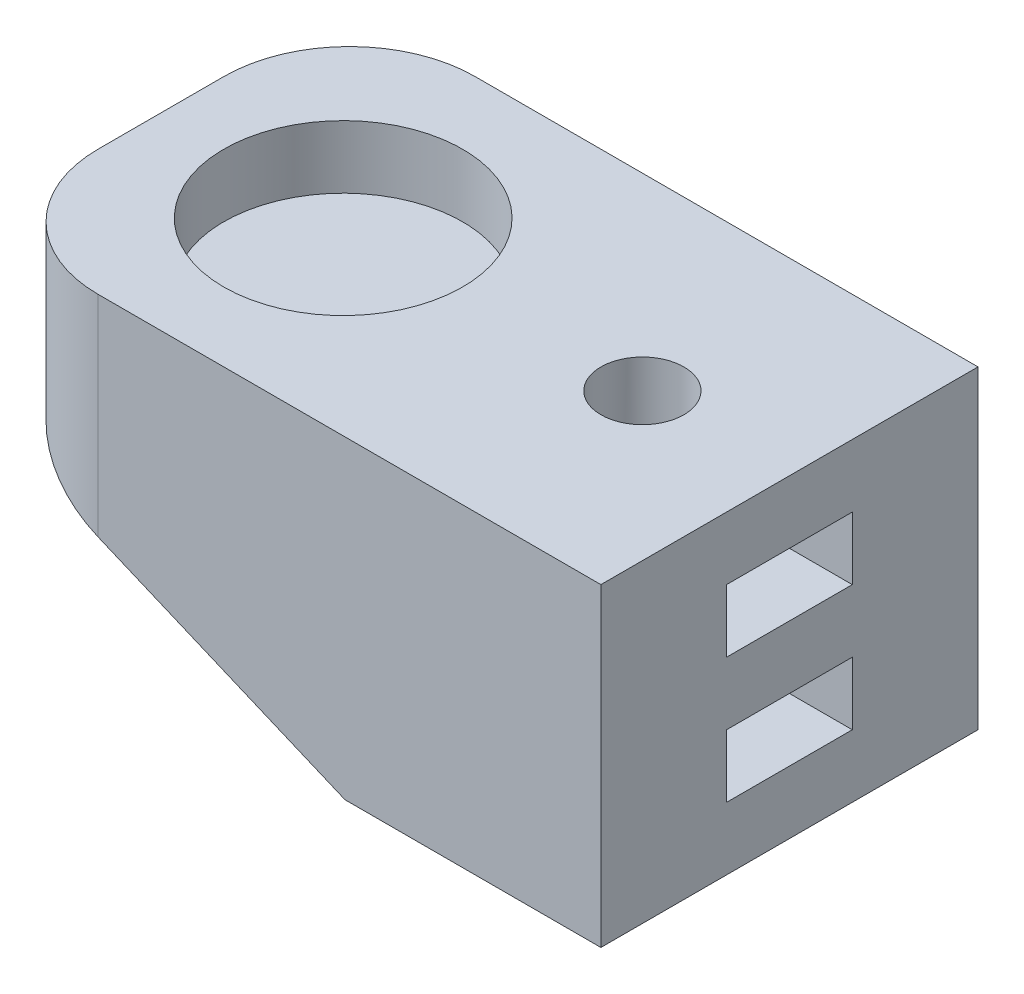
ISO-10303-21;
HEADER;
FILE_DESCRIPTION(('STEP AP214'),'2;1');
FILE_NAME('part.step','',(''),(''),'','','');
FILE_SCHEMA(('AUTOMOTIVE_DESIGN { 1 0 10303 214 1 1 1 1 }'));
ENDSEC;
DATA;
#1=APPLICATION_CONTEXT('core data for automotive mechanical design processes');
#2=APPLICATION_PROTOCOL_DEFINITION('international standard','automotive_design',2000,#1);
#3=PRODUCT_CONTEXT('',#1,'mechanical');
#4=PRODUCT('Part','Part','',(#3));
#5=PRODUCT_RELATED_PRODUCT_CATEGORY('part','',(#4));
#6=PRODUCT_DEFINITION_FORMATION('','',#4);
#7=PRODUCT_DEFINITION_CONTEXT('part definition',#1,'design');
#8=PRODUCT_DEFINITION('design','',#6,#7);
#9=PRODUCT_DEFINITION_SHAPE('','',#8);
#10=(LENGTH_UNIT() NAMED_UNIT(*) SI_UNIT(.MILLI.,.METRE.));
#11=(NAMED_UNIT(*) PLANE_ANGLE_UNIT() SI_UNIT($,.RADIAN.));
#12=(NAMED_UNIT(*) SI_UNIT($,.STERADIAN.) SOLID_ANGLE_UNIT());
#13=UNCERTAINTY_MEASURE_WITH_UNIT(LENGTH_MEASURE(1.E-05),#10,'distance_accuracy_value','');
#14=(GEOMETRIC_REPRESENTATION_CONTEXT(3) GLOBAL_UNCERTAINTY_ASSIGNED_CONTEXT((#13)) GLOBAL_UNIT_ASSIGNED_CONTEXT((#10,
#11,#12)) REPRESENTATION_CONTEXT('',''));
#15=CARTESIAN_POINT('',(0.,0.,0.));
#16=DIRECTION('',(0.,0.,1.));
#17=DIRECTION('',(1.,0.,0.));
#18=AXIS2_PLACEMENT_3D('',#15,#16,#17);
#19=CARTESIAN_POINT('',(-10.5419782215743,25.,-46.9400359779606));
#20=DIRECTION('',(-1.,0.,0.));
#21=DIRECTION('',(0.,0.,1.));
#22=AXIS2_PLACEMENT_3D('',#19,#20,#21);
#23=PLANE('',#22);
#24=DIRECTION('',(0.,0.,1.));
#25=VECTOR('',#24,1.);
#26=CARTESIAN_POINT('',(-10.5419782215743,10.,0.));
#27=LINE('',#26,#25);
#28=CARTESIAN_POINT('',(-10.5419782215743,10.,-36.9400359779606));
#29=VERTEX_POINT('',#28);
#30=CARTESIAN_POINT('',(-10.5419782215743,10.,-26.9400359779606));
#31=VERTEX_POINT('',#30);
#32=EDGE_CURVE('E212',#29,#31,#27,.T.);
#33=ORIENTED_EDGE('',*,*,#32,.F.);
#34=DIRECTION('',(0.,-1.,0.));
#35=VECTOR('',#34,1.);
#36=CARTESIAN_POINT('',(-10.5419782215743,10.,-36.9400359779606));
#37=LINE('',#36,#35);
#38=CARTESIAN_POINT('',(-10.5419782215743,5.,-36.9400359779606));
#39=VERTEX_POINT('',#38);
#40=EDGE_CURVE('E224',#29,#39,#37,.T.);
#41=ORIENTED_EDGE('',*,*,#40,.T.);
#42=DIRECTION('',(0.,0.,1.));
#43=VECTOR('',#42,1.);
#44=CARTESIAN_POINT('',(-10.5419782215743,5.,0.));
#45=LINE('',#44,#43);
#46=CARTESIAN_POINT('',(-10.5419782215743,5.,-26.9400359779606));
#47=VERTEX_POINT('',#46);
#48=EDGE_CURVE('E230',#39,#47,#45,.T.);
#49=ORIENTED_EDGE('',*,*,#48,.T.);
#50=DIRECTION('',(0.,-1.,0.));
#51=VECTOR('',#50,1.);
#52=CARTESIAN_POINT('',(-10.5419782215743,10.,-26.9400359779606));
#53=LINE('',#52,#51);
#54=EDGE_CURVE('E246',#31,#47,#53,.T.);
#55=ORIENTED_EDGE('',*,*,#54,.F.);
#56=EDGE_LOOP('',(#33,#41,#49,#55));
#57=FACE_BOUND('',#56,.T.);
#58=DIRECTION('',(0.,0.,-1.));
#59=VECTOR('',#58,1.);
#60=CARTESIAN_POINT('',(-10.5419782215743,0.,-46.9400359779606));
#61=LINE('',#60,#59);
#62=CARTESIAN_POINT('',(-10.5419782215743,0.,-16.9400359779606));
#63=VERTEX_POINT('',#62);
#64=CARTESIAN_POINT('',(-10.5419782215743,0.,-46.9400359779606));
#65=VERTEX_POINT('',#64);
#66=EDGE_CURVE('E283',#63,#65,#61,.T.);
#67=ORIENTED_EDGE('',*,*,#66,.T.);
#68=DIRECTION('',(0.,-1.,0.));
#69=VECTOR('',#68,1.);
#70=CARTESIAN_POINT('',(-10.5419782215743,25.,-46.9400359779606));
#71=LINE('',#70,#69);
#72=CARTESIAN_POINT('',(-10.5419782215743,25.,-46.9400359779606));
#73=VERTEX_POINT('',#72);
#74=EDGE_CURVE('E281',#73,#65,#71,.T.);
#75=ORIENTED_EDGE('',*,*,#74,.F.);
#76=DIRECTION('',(0.,0.,-1.));
#77=VECTOR('',#76,1.);
#78=CARTESIAN_POINT('',(-10.5419782215743,25.,-46.9400359779606));
#79=LINE('',#78,#77);
#80=CARTESIAN_POINT('',(-10.5419782215743,25.,-16.9400359779606));
#81=VERTEX_POINT('',#80);
#82=EDGE_CURVE('E276',#81,#73,#79,.T.);
#83=ORIENTED_EDGE('',*,*,#82,.F.);
#84=DIRECTION('',(0.,-1.,0.));
#85=VECTOR('',#84,1.);
#86=CARTESIAN_POINT('',(-10.5419782215743,25.,-16.9400359779606));
#87=LINE('',#86,#85);
#88=EDGE_CURVE('E289',#81,#63,#87,.T.);
#89=ORIENTED_EDGE('',*,*,#88,.T.);
#90=EDGE_LOOP('',(#67,#75,#83,#89));
#91=FACE_BOUND('',#90,.T.);
#92=DIRECTION('',(0.,0.,1.));
#93=VECTOR('',#92,1.);
#94=CARTESIAN_POINT('',(-10.5419782215743,20.,0.));
#95=LINE('',#94,#93);
#96=CARTESIAN_POINT('',(-10.5419782215743,20.,-36.9400359779606));
#97=VERTEX_POINT('',#96);
#98=CARTESIAN_POINT('',(-10.5419782215743,20.,-26.9400359779606));
#99=VERTEX_POINT('',#98);
#100=EDGE_CURVE('E170',#97,#99,#95,.T.);
#101=ORIENTED_EDGE('',*,*,#100,.F.);
#102=DIRECTION('',(0.,-1.,0.));
#103=VECTOR('',#102,1.);
#104=CARTESIAN_POINT('',(-10.5419782215743,20.,-36.9400359779606));
#105=LINE('',#104,#103);
#106=CARTESIAN_POINT('',(-10.5419782215743,15.,-36.9400359779606));
#107=VERTEX_POINT('',#106);
#108=EDGE_CURVE('E153',#97,#107,#105,.T.);
#109=ORIENTED_EDGE('',*,*,#108,.T.);
#110=DIRECTION('',(0.,0.,1.));
#111=VECTOR('',#110,1.);
#112=CARTESIAN_POINT('',(-10.5419782215743,15.,0.));
#113=LINE('',#112,#111);
#114=CARTESIAN_POINT('',(-10.5419782215743,15.,-26.9400359779606));
#115=VERTEX_POINT('',#114);
#116=EDGE_CURVE('E188',#107,#115,#113,.T.);
#117=ORIENTED_EDGE('',*,*,#116,.T.);
#118=DIRECTION('',(0.,-1.,0.));
#119=VECTOR('',#118,1.);
#120=CARTESIAN_POINT('',(-10.5419782215743,20.,-26.9400359779606));
#121=LINE('',#120,#119);
#122=EDGE_CURVE('E163',#99,#115,#121,.T.);
#123=ORIENTED_EDGE('',*,*,#122,.F.);
#124=EDGE_LOOP('',(#101,#109,#117,#123));
#125=FACE_BOUND('',#124,.T.);
#126=ADVANCED_FACE('F32',(#57,#91,#125),#23,.F.);
#127=CARTESIAN_POINT('',(-22.2401365745473,-5.,-31.9400359779606));
#128=DIRECTION('',(0.,1.,0.));
#129=DIRECTION('',(0.,0.,1.));
#130=AXIS2_PLACEMENT_3D('',#127,#128,#129);
#131=CYLINDRICAL_SURFACE('',#130,3.3);
#132=CARTESIAN_POINT('',(-22.2401365745473,25.,-31.9400359779606));
#133=DIRECTION('',(0.,1.,0.));
#134=DIRECTION('',(0.,0.,1.));
#135=AXIS2_PLACEMENT_3D('',#132,#133,#134);
#136=CIRCLE('',#135,3.3);
#137=CARTESIAN_POINT('',(-22.2401365745473,25.,-28.6400359779606));
#138=VERTEX_POINT('',#137);
#139=EDGE_CURVE('E257',#138,#138,#136,.T.);
#140=ORIENTED_EDGE('',*,*,#139,.T.);
#141=EDGE_LOOP('',(#140));
#142=FACE_BOUND('',#141,.T.);
#143=CARTESIAN_POINT('',(-22.2401365745473,20.,-31.9400359779606));
#144=DIRECTION('',(0.,-1.,0.));
#145=DIRECTION('',(0.,0.,-1.));
#146=AXIS2_PLACEMENT_3D('',#143,#144,#145);
#147=CIRCLE('',#146,3.3);
#148=CARTESIAN_POINT('',(-22.2401365745473,20.,-35.2400359779606));
#149=VERTEX_POINT('',#148);
#150=EDGE_CURVE('E174',#149,#149,#147,.F.);
#151=ORIENTED_EDGE('',*,*,#150,.F.);
#152=EDGE_LOOP('',(#151));
#153=FACE_BOUND('',#152,.T.);
#154=ADVANCED_FACE('F343',(#142,#153),#131,.F.);
#155=CARTESIAN_POINT('',(-22.2401365745473,15.,-31.9400359779606));
#156=DIRECTION('',(0.,-1.,0.));
#157=DIRECTION('',(0.,0.,-1.));
#158=AXIS2_PLACEMENT_3D('',#155,#156,#157);
#159=CIRCLE('',#158,3.3);
#160=CARTESIAN_POINT('',(-22.2401365745473,15.,-35.2400359779606));
#161=VERTEX_POINT('',#160);
#162=EDGE_CURVE('E184',#161,#161,#159,.F.);
#163=ORIENTED_EDGE('',*,*,#162,.T.);
#164=EDGE_LOOP('',(#163));
#165=FACE_BOUND('',#164,.T.);
#166=CARTESIAN_POINT('',(-22.2401365745473,10.,-31.9400359779606));
#167=DIRECTION('',(0.,-1.,0.));
#168=DIRECTION('',(0.,0.,-1.));
#169=AXIS2_PLACEMENT_3D('',#166,#167,#168);
#170=CIRCLE('',#169,3.3);
#171=CARTESIAN_POINT('',(-22.2401365745473,10.,-35.2400359779606));
#172=VERTEX_POINT('',#171);
#173=EDGE_CURVE('E205',#172,#172,#170,.F.);
#174=ORIENTED_EDGE('',*,*,#173,.F.);
#175=EDGE_LOOP('',(#174));
#176=FACE_BOUND('',#175,.T.);
#177=ADVANCED_FACE('F349',(#165,#176),#131,.F.);
#178=CARTESIAN_POINT('',(-60.5419782215743,25.,-46.9400359779606));
#179=DIRECTION('',(1.,0.,0.));
#180=DIRECTION('',(0.,0.,-1.));
#181=AXIS2_PLACEMENT_3D('',#178,#179,#180);
#182=PLANE('',#181);
#183=DIRECTION('',(0.,0.,-1.));
#184=VECTOR('',#183,1.);
#185=CARTESIAN_POINT('',(-60.5419782215743,12.5,-16.9400359779606));
#186=LINE('',#185,#184);
#187=CARTESIAN_POINT('',(-60.5419782215743,12.5,-26.9400359779606));
#188=VERTEX_POINT('',#187);
#189=CARTESIAN_POINT('',(-60.5419782215743,12.5,-36.9400359779606));
#190=VERTEX_POINT('',#189);
#191=EDGE_CURVE('E252',#188,#190,#186,.T.);
#192=ORIENTED_EDGE('',*,*,#191,.F.);
#193=DIRECTION('',(0.,-1.,0.));
#194=VECTOR('',#193,1.);
#195=CARTESIAN_POINT('',(-60.5419782215743,25.,-26.9400359779606));
#196=LINE('',#195,#194);
#197=CARTESIAN_POINT('',(-60.5419782215743,25.,-26.9400359779606));
#198=VERTEX_POINT('',#197);
#199=EDGE_CURVE('E304',#188,#198,#196,.F.);
#200=ORIENTED_EDGE('',*,*,#199,.T.);
#201=DIRECTION('',(0.,0.,1.));
#202=VECTOR('',#201,1.);
#203=CARTESIAN_POINT('',(-60.5419782215743,25.,-46.9400359779606));
#204=LINE('',#203,#202);
#205=CARTESIAN_POINT('',(-60.5419782215743,25.,-36.9400359779606));
#206=VERTEX_POINT('',#205);
#207=EDGE_CURVE('E270',#206,#198,#204,.T.);
#208=ORIENTED_EDGE('',*,*,#207,.F.);
#209=DIRECTION('',(0.,-1.,0.));
#210=VECTOR('',#209,1.);
#211=CARTESIAN_POINT('',(-60.5419782215743,25.,-36.9400359779606));
#212=LINE('',#211,#210);
#213=EDGE_CURVE('E301',#206,#190,#212,.T.);
#214=ORIENTED_EDGE('',*,*,#213,.T.);
#215=EDGE_LOOP('',(#192,#200,#208,#214));
#216=FACE_BOUND('',#215,.T.);
#217=ADVANCED_FACE('F326',(#216),#182,.F.);
#218=CARTESIAN_POINT('',(-60.5419782215743,25.,-16.9400359779606));
#219=DIRECTION('',(0.,0.,-1.));
#220=DIRECTION('',(-1.,0.,0.));
#221=AXIS2_PLACEMENT_3D('',#218,#219,#220);
#222=PLANE('',#221);
#223=DIRECTION('',(1.,0.,0.));
#224=VECTOR('',#223,1.);
#225=CARTESIAN_POINT('',(-60.5419782215743,25.,-16.9400359779606));
#226=LINE('',#225,#224);
#227=CARTESIAN_POINT('',(-50.5419782215743,25.,-16.9400359779606));
#228=VERTEX_POINT('',#227);
#229=EDGE_CURVE('E273',#228,#81,#226,.T.);
#230=ORIENTED_EDGE('',*,*,#229,.F.);
#231=DIRECTION('',(0.,-1.,0.));
#232=VECTOR('',#231,1.);
#233=CARTESIAN_POINT('',(-50.5419782215743,25.,-16.9400359779606));
#234=LINE('',#233,#232);
#235=CARTESIAN_POINT('',(-50.5419782215743,8.28276018423501,-16.9400359779606));
#236=VERTEX_POINT('',#235);
#237=EDGE_CURVE('E292',#228,#236,#234,.T.);
#238=ORIENTED_EDGE('',*,*,#237,.T.);
#239=DIRECTION('',(0.921413988006247,-0.388582375702274,0.));
#240=VECTOR('',#239,1.);
#241=CARTESIAN_POINT('',(-30.9017382872167,0.,-16.9400359779606));
#242=LINE('',#241,#240);
#243=CARTESIAN_POINT('',(-30.9017382872167,0.,-16.9400359779606));
#244=VERTEX_POINT('',#243);
#245=EDGE_CURVE('E250',#236,#244,#242,.T.);
#246=ORIENTED_EDGE('',*,*,#245,.T.);
#247=DIRECTION('',(1.,0.,0.));
#248=VECTOR('',#247,1.);
#249=CARTESIAN_POINT('',(-60.5419782215743,0.,-16.9400359779606));
#250=LINE('',#249,#248);
#251=EDGE_CURVE('E266',#244,#63,#250,.T.);
#252=ORIENTED_EDGE('',*,*,#251,.T.);
#253=ORIENTED_EDGE('',*,*,#88,.F.);
#254=EDGE_LOOP('',(#230,#238,#246,#252,#253));
#255=FACE_BOUND('',#254,.T.);
#256=ADVANCED_FACE('F317',(#255),#222,.F.);
#257=CARTESIAN_POINT('',(-60.5419782215743,25.,-46.9400359779606));
#258=DIRECTION('',(0.,0.,1.));
#259=DIRECTION('',(1.,0.,0.));
#260=AXIS2_PLACEMENT_3D('',#257,#258,#259);
#261=PLANE('',#260);
#262=DIRECTION('',(0.921413988006247,-0.388582375702274,0.));
#263=VECTOR('',#262,1.);
#264=CARTESIAN_POINT('',(-30.9017382872167,0.,-46.9400359779606));
#265=LINE('',#264,#263);
#266=CARTESIAN_POINT('',(-50.5419782215743,8.28276018423502,-46.9400359779606));
#267=VERTEX_POINT('',#266);
#268=CARTESIAN_POINT('',(-30.9017382872167,0.,-46.9400359779606));
#269=VERTEX_POINT('',#268);
#270=EDGE_CURVE('E241',#267,#269,#265,.T.);
#271=ORIENTED_EDGE('',*,*,#270,.F.);
#272=DIRECTION('',(0.,-1.,0.));
#273=VECTOR('',#272,1.);
#274=CARTESIAN_POINT('',(-50.5419782215743,25.,-46.9400359779606));
#275=LINE('',#274,#273);
#276=CARTESIAN_POINT('',(-50.5419782215743,25.,-46.9400359779606));
#277=VERTEX_POINT('',#276);
#278=EDGE_CURVE('E11',#267,#277,#275,.F.);
#279=ORIENTED_EDGE('',*,*,#278,.T.);
#280=DIRECTION('',(-1.,0.,0.));
#281=VECTOR('',#280,1.);
#282=CARTESIAN_POINT('',(-60.5419782215743,25.,-46.9400359779606));
#283=LINE('',#282,#281);
#284=EDGE_CURVE('E278',#73,#277,#283,.T.);
#285=ORIENTED_EDGE('',*,*,#284,.F.);
#286=ORIENTED_EDGE('',*,*,#74,.T.);
#287=DIRECTION('',(-1.,0.,0.));
#288=VECTOR('',#287,1.);
#289=CARTESIAN_POINT('',(-60.5419782215743,0.,-46.9400359779606));
#290=LINE('',#289,#288);
#291=EDGE_CURVE('E274',#65,#269,#290,.T.);
#292=ORIENTED_EDGE('',*,*,#291,.T.);
#293=EDGE_LOOP('',(#271,#279,#285,#286,#292));
#294=FACE_BOUND('',#293,.T.);
#295=ADVANCED_FACE('F333',(#294),#261,.F.);
#296=CARTESIAN_POINT('',(0.,25.,0.));
#297=DIRECTION('',(0.,1.,0.));
#298=DIRECTION('',(0.,0.,1.));
#299=AXIS2_PLACEMENT_3D('',#296,#297,#298);
#300=PLANE('',#299);
#301=ORIENTED_EDGE('',*,*,#139,.F.);
#302=EDGE_LOOP('',(#301));
#303=FACE_BOUND('',#302,.T.);
#304=CARTESIAN_POINT('',(-46.0419782215743,25.,-31.9400359779606));
#305=DIRECTION('',(0.,1.,0.));
#306=DIRECTION('',(0.,0.,1.));
#307=AXIS2_PLACEMENT_3D('',#304,#305,#306);
#308=CIRCLE('',#307,9.5);
#309=CARTESIAN_POINT('',(-46.0419782215743,25.,-22.4400359779606));
#310=VERTEX_POINT('',#309);
#311=EDGE_CURVE('E267',#310,#310,#308,.T.);
#312=ORIENTED_EDGE('',*,*,#311,.F.);
#313=EDGE_LOOP('',(#312));
#314=FACE_BOUND('',#313,.T.);
#315=ORIENTED_EDGE('',*,*,#207,.T.);
#316=CARTESIAN_POINT('',(-50.5419782215743,25.,-26.9400359779606));
#317=DIRECTION('',(0.,1.,0.));
#318=DIRECTION('',(0.,0.,1.));
#319=AXIS2_PLACEMENT_3D('',#316,#317,#318);
#320=CIRCLE('',#319,10.);
#321=EDGE_CURVE('E40',#198,#228,#320,.T.);
#322=ORIENTED_EDGE('',*,*,#321,.T.);
#323=ORIENTED_EDGE('',*,*,#229,.T.);
#324=ORIENTED_EDGE('',*,*,#82,.T.);
#325=ORIENTED_EDGE('',*,*,#284,.T.);
#326=CARTESIAN_POINT('',(-50.5419782215743,25.,-36.9400359779606));
#327=DIRECTION('',(0.,1.,0.));
#328=DIRECTION('',(0.,0.,1.));
#329=AXIS2_PLACEMENT_3D('',#326,#327,#328);
#330=CIRCLE('',#329,10.);
#331=EDGE_CURVE('E306',#277,#206,#330,.T.);
#332=ORIENTED_EDGE('',*,*,#331,.T.);
#333=EDGE_LOOP('',(#315,#322,#323,#324,#325,#332));
#334=FACE_BOUND('',#333,.T.);
#335=ADVANCED_FACE('F310',(#303,#314,#334),#300,.T.);
#336=CARTESIAN_POINT('',(0.,0.,0.));
#337=DIRECTION('',(0.,1.,0.));
#338=DIRECTION('',(0.,0.,1.));
#339=AXIS2_PLACEMENT_3D('',#336,#337,#338);
#340=PLANE('',#339);
#341=CARTESIAN_POINT('',(-22.2401365745473,0.,-31.9400359779606));
#342=DIRECTION('',(0.,1.,0.));
#343=DIRECTION('',(0.,0.,1.));
#344=AXIS2_PLACEMENT_3D('',#341,#342,#343);
#345=CIRCLE('',#344,3.3);
#346=CARTESIAN_POINT('',(-22.2401365745473,0.,-28.6400359779606));
#347=VERTEX_POINT('',#346);
#348=EDGE_CURVE('E262',#347,#347,#345,.T.);
#349=ORIENTED_EDGE('',*,*,#348,.T.);
#350=EDGE_LOOP('',(#349));
#351=FACE_BOUND('',#350,.T.);
#352=ORIENTED_EDGE('',*,*,#251,.F.);
#353=DIRECTION('',(0.,0.,-1.));
#354=VECTOR('',#353,1.);
#355=CARTESIAN_POINT('',(-30.9017382872167,0.,-16.9400359779606));
#356=LINE('',#355,#354);
#357=EDGE_CURVE('E254',#244,#269,#356,.T.);
#358=ORIENTED_EDGE('',*,*,#357,.T.);
#359=ORIENTED_EDGE('',*,*,#291,.F.);
#360=ORIENTED_EDGE('',*,*,#66,.F.);
#361=EDGE_LOOP('',(#352,#358,#359,#360));
#362=FACE_BOUND('',#361,.T.);
#363=ADVANCED_FACE('F340',(#351,#362),#340,.F.);
#364=CARTESIAN_POINT('',(-46.0419782215743,20.,-31.9400359779606));
#365=DIRECTION('',(0.,1.,0.));
#366=DIRECTION('',(0.,0.,1.));
#367=AXIS2_PLACEMENT_3D('',#364,#365,#366);
#368=CYLINDRICAL_SURFACE('',#367,9.5);
#369=CARTESIAN_POINT('',(-46.0419782215743,20.,-31.9400359779606));
#370=DIRECTION('',(0.,1.,0.));
#371=DIRECTION('',(0.,0.,1.));
#372=AXIS2_PLACEMENT_3D('',#369,#370,#371);
#373=CIRCLE('',#372,9.5);
#374=CARTESIAN_POINT('',(-46.0419782215743,20.,-22.4400359779606));
#375=VERTEX_POINT('',#374);
#376=EDGE_CURVE('E263',#375,#375,#373,.T.);
#377=ORIENTED_EDGE('',*,*,#376,.F.);
#378=EDGE_LOOP('',(#377));
#379=FACE_BOUND('',#378,.T.);
#380=ORIENTED_EDGE('',*,*,#311,.T.);
#381=EDGE_LOOP('',(#380));
#382=FACE_BOUND('',#381,.T.);
#383=ADVANCED_FACE('F377',(#379,#382),#368,.F.);
#384=CARTESIAN_POINT('',(-46.0419782215743,20.,-31.9400359779606));
#385=DIRECTION('',(0.,1.,0.));
#386=DIRECTION('',(0.,0.,1.));
#387=AXIS2_PLACEMENT_3D('',#384,#385,#386);
#388=PLANE('',#387);
#389=ORIENTED_EDGE('',*,*,#376,.T.);
#390=EDGE_LOOP('',(#389));
#391=FACE_BOUND('',#390,.T.);
#392=ADVANCED_FACE('F370',(#391),#388,.T.);
#393=CARTESIAN_POINT('',(-22.2401365745473,5.,-31.9400359779606));
#394=DIRECTION('',(0.,-1.,0.));
#395=DIRECTION('',(0.,0.,-1.));
#396=AXIS2_PLACEMENT_3D('',#393,#394,#395);
#397=CIRCLE('',#396,3.3);
#398=CARTESIAN_POINT('',(-22.2401365745473,5.,-35.2400359779606));
#399=VERTEX_POINT('',#398);
#400=EDGE_CURVE('E199',#399,#399,#397,.F.);
#401=ORIENTED_EDGE('',*,*,#400,.T.);
#402=EDGE_LOOP('',(#401));
#403=FACE_BOUND('',#402,.T.);
#404=ORIENTED_EDGE('',*,*,#348,.F.);
#405=EDGE_LOOP('',(#404));
#406=FACE_BOUND('',#405,.T.);
#407=ADVANCED_FACE('F352',(#403,#406),#131,.F.);
#408=CARTESIAN_POINT('',(-30.9017382872167,0.,-16.9400359779606));
#409=DIRECTION('',(0.388582375702274,0.921413988006247,0.));
#410=DIRECTION('',(-0.921413988006247,0.388582375702274,0.));
#411=AXIS2_PLACEMENT_3D('',#408,#409,#410);
#412=PLANE('',#411);
#413=ORIENTED_EDGE('',*,*,#245,.F.);
#414=CARTESIAN_POINT('',(-50.5419782215743,8.28276018423502,-26.9400359779606));
#415=DIRECTION('',(0.388582375702274,0.921413988006247,0.));
#416=DIRECTION('',(0.921413988006247,-0.388582375702274,0.));
#417=AXIS2_PLACEMENT_3D('',#414,#415,#416);
#418=ELLIPSE('',#417,10.8528849465787,10.);
#419=EDGE_CURVE('E299',#236,#188,#418,.F.);
#420=ORIENTED_EDGE('',*,*,#419,.T.);
#421=ORIENTED_EDGE('',*,*,#191,.T.);
#422=CARTESIAN_POINT('',(-50.5419782215743,8.28276018423502,-36.9400359779606));
#423=DIRECTION('',(0.388582375702274,0.921413988006247,0.));
#424=DIRECTION('',(0.921413988006247,-0.388582375702274,0.));
#425=AXIS2_PLACEMENT_3D('',#422,#423,#424);
#426=ELLIPSE('',#425,10.8528849465787,10.);
#427=EDGE_CURVE('E297',#190,#267,#426,.F.);
#428=ORIENTED_EDGE('',*,*,#427,.T.);
#429=ORIENTED_EDGE('',*,*,#270,.T.);
#430=ORIENTED_EDGE('',*,*,#357,.F.);
#431=EDGE_LOOP('',(#413,#420,#421,#428,#429,#430));
#432=FACE_BOUND('',#431,.T.);
#433=ADVANCED_FACE('F323',(#432),#412,.F.);
#434=CARTESIAN_POINT('',(-50.5419782215743,25.,-26.9400359779606));
#435=DIRECTION('',(0.,-1.,0.));
#436=DIRECTION('',(0.,0.,-1.));
#437=AXIS2_PLACEMENT_3D('',#434,#435,#436);
#438=CYLINDRICAL_SURFACE('',#437,10.);
#439=ORIENTED_EDGE('',*,*,#321,.F.);
#440=ORIENTED_EDGE('',*,*,#199,.F.);
#441=ORIENTED_EDGE('',*,*,#419,.F.);
#442=ORIENTED_EDGE('',*,*,#237,.F.);
#443=EDGE_LOOP('',(#439,#440,#441,#442));
#444=FACE_BOUND('',#443,.T.);
#445=ADVANCED_FACE('F320',(#444),#438,.T.);
#446=CARTESIAN_POINT('',(-50.5419782215743,25.,-36.9400359779606));
#447=DIRECTION('',(0.,-1.,0.));
#448=DIRECTION('',(0.,0.,-1.));
#449=AXIS2_PLACEMENT_3D('',#446,#447,#448);
#450=CYLINDRICAL_SURFACE('',#449,10.);
#451=ORIENTED_EDGE('',*,*,#331,.F.);
#452=ORIENTED_EDGE('',*,*,#278,.F.);
#453=ORIENTED_EDGE('',*,*,#427,.F.);
#454=ORIENTED_EDGE('',*,*,#213,.F.);
#455=EDGE_LOOP('',(#451,#452,#453,#454));
#456=FACE_BOUND('',#455,.T.);
#457=ADVANCED_FACE('F34',(#456),#450,.T.);
#458=CARTESIAN_POINT('',(0.,10.,-36.9400359779606));
#459=DIRECTION('',(0.,0.,-1.));
#460=DIRECTION('',(-1.,0.,0.));
#461=AXIS2_PLACEMENT_3D('',#458,#459,#460);
#462=PLANE('',#461);
#463=DIRECTION('',(1.,0.,0.));
#464=VECTOR('',#463,1.);
#465=CARTESIAN_POINT('',(0.,5.,-36.9400359779606));
#466=LINE('',#465,#464);
#467=CARTESIAN_POINT('',(-25.1268879204953,5.,-36.9400359779606));
#468=VERTEX_POINT('',#467);
#469=EDGE_CURVE('E227',#468,#39,#466,.T.);
#470=ORIENTED_EDGE('',*,*,#469,.T.);
#471=ORIENTED_EDGE('',*,*,#40,.F.);
#472=DIRECTION('',(1.,0.,0.));
#473=VECTOR('',#472,1.);
#474=CARTESIAN_POINT('',(0.,10.,-36.9400359779606));
#475=LINE('',#474,#473);
#476=CARTESIAN_POINT('',(-25.1268879204953,10.,-36.9400359779606));
#477=VERTEX_POINT('',#476);
#478=EDGE_CURVE('E208',#477,#29,#475,.T.);
#479=ORIENTED_EDGE('',*,*,#478,.F.);
#480=DIRECTION('',(0.,-1.,0.));
#481=VECTOR('',#480,1.);
#482=CARTESIAN_POINT('',(-25.1268879204953,10.,-36.9400359779606));
#483=LINE('',#482,#481);
#484=EDGE_CURVE('E239',#477,#468,#483,.T.);
#485=ORIENTED_EDGE('',*,*,#484,.T.);
#486=EDGE_LOOP('',(#470,#471,#479,#485));
#487=FACE_BOUND('',#486,.T.);
#488=ADVANCED_FACE('F365',(#487),#462,.F.);
#489=CARTESIAN_POINT('',(-34.840670727184,10.,-20.1152706230868));
#490=DIRECTION('',(-0.866025403784438,0.,-0.500000000000001));
#491=DIRECTION('',(-0.500000000000001,0.,0.866025403784438));
#492=AXIS2_PLACEMENT_3D('',#489,#490,#491);
#493=PLANE('',#492);
#494=DIRECTION('',(0.500000000000001,0.,-0.866025403784438));
#495=VECTOR('',#494,1.);
#496=CARTESIAN_POINT('',(-34.840670727184,5.,-20.1152706230868));
#497=LINE('',#496,#495);
#498=CARTESIAN_POINT('',(-28.0136392664434,5.,-31.9400359779606));
#499=VERTEX_POINT('',#498);
#500=EDGE_CURVE('E209',#499,#468,#497,.T.);
#501=ORIENTED_EDGE('',*,*,#500,.T.);
#502=ORIENTED_EDGE('',*,*,#484,.F.);
#503=DIRECTION('',(0.500000000000001,0.,-0.866025403784438));
#504=VECTOR('',#503,1.);
#505=CARTESIAN_POINT('',(-34.840670727184,10.,-20.1152706230868));
#506=LINE('',#505,#504);
#507=CARTESIAN_POINT('',(-28.0136392664434,10.,-31.9400359779606));
#508=VERTEX_POINT('',#507);
#509=EDGE_CURVE('E221',#508,#477,#506,.T.);
#510=ORIENTED_EDGE('',*,*,#509,.F.);
#511=DIRECTION('',(0.,-1.,0.));
#512=VECTOR('',#511,1.);
#513=CARTESIAN_POINT('',(-28.0136392664434,10.,-31.9400359779606));
#514=LINE('',#513,#512);
#515=EDGE_CURVE('E242',#508,#499,#514,.T.);
#516=ORIENTED_EDGE('',*,*,#515,.T.);
#517=EDGE_LOOP('',(#501,#502,#510,#516));
#518=FACE_BOUND('',#517,.T.);
#519=ADVANCED_FACE('F419',(#518),#493,.F.);
#520=CARTESIAN_POINT('',(-7.17978817248113,10.,4.14525263410648));
#521=DIRECTION('',(-0.866025403784438,0.,0.5));
#522=DIRECTION('',(0.5,0.,0.866025403784438));
#523=AXIS2_PLACEMENT_3D('',#520,#521,#522);
#524=PLANE('',#523);
#525=DIRECTION('',(-0.5,0.,-0.866025403784439));
#526=VECTOR('',#525,1.);
#527=CARTESIAN_POINT('',(-7.17978817248113,5.,4.14525263410648));
#528=LINE('',#527,#526);
#529=CARTESIAN_POINT('',(-25.1268879204953,5.,-26.9400359779606));
#530=VERTEX_POINT('',#529);
#531=EDGE_CURVE('E234',#530,#499,#528,.T.);
#532=ORIENTED_EDGE('',*,*,#531,.T.);
#533=ORIENTED_EDGE('',*,*,#515,.F.);
#534=DIRECTION('',(-0.5,0.,-0.866025403784439));
#535=VECTOR('',#534,1.);
#536=CARTESIAN_POINT('',(-7.17978817248113,10.,4.14525263410648));
#537=LINE('',#536,#535);
#538=CARTESIAN_POINT('',(-25.1268879204953,10.,-26.9400359779606));
#539=VERTEX_POINT('',#538);
#540=EDGE_CURVE('E218',#539,#508,#537,.T.);
#541=ORIENTED_EDGE('',*,*,#540,.F.);
#542=DIRECTION('',(0.,-1.,0.));
#543=VECTOR('',#542,1.);
#544=CARTESIAN_POINT('',(-25.1268879204953,10.,-26.9400359779606));
#545=LINE('',#544,#543);
#546=EDGE_CURVE('E244',#539,#530,#545,.T.);
#547=ORIENTED_EDGE('',*,*,#546,.T.);
#548=EDGE_LOOP('',(#532,#533,#541,#547));
#549=FACE_BOUND('',#548,.T.);
#550=ADVANCED_FACE('F429',(#549),#524,.F.);
#551=CARTESIAN_POINT('',(0.,10.,-26.9400359779606));
#552=DIRECTION('',(0.,0.,1.));
#553=DIRECTION('',(1.,0.,0.));
#554=AXIS2_PLACEMENT_3D('',#551,#552,#553);
#555=PLANE('',#554);
#556=DIRECTION('',(-1.,0.,0.));
#557=VECTOR('',#556,1.);
#558=CARTESIAN_POINT('',(0.,5.,-26.9400359779606));
#559=LINE('',#558,#557);
#560=EDGE_CURVE('E55',#47,#530,#559,.T.);
#561=ORIENTED_EDGE('',*,*,#560,.T.);
#562=ORIENTED_EDGE('',*,*,#546,.F.);
#563=DIRECTION('',(-1.,0.,0.));
#564=VECTOR('',#563,1.);
#565=CARTESIAN_POINT('',(0.,10.,-26.9400359779606));
#566=LINE('',#565,#564);
#567=EDGE_CURVE('E215',#31,#539,#566,.T.);
#568=ORIENTED_EDGE('',*,*,#567,.F.);
#569=ORIENTED_EDGE('',*,*,#54,.T.);
#570=EDGE_LOOP('',(#561,#562,#568,#569));
#571=FACE_BOUND('',#570,.T.);
#572=ADVANCED_FACE('F439',(#571),#555,.F.);
#573=CARTESIAN_POINT('',(0.,10.,0.));
#574=DIRECTION('',(0.,-1.,0.));
#575=DIRECTION('',(0.,0.,-1.));
#576=AXIS2_PLACEMENT_3D('',#573,#574,#575);
#577=PLANE('',#576);
#578=ORIENTED_EDGE('',*,*,#173,.T.);
#579=EDGE_LOOP('',(#578));
#580=FACE_BOUND('',#579,.T.);
#581=ORIENTED_EDGE('',*,*,#478,.T.);
#582=ORIENTED_EDGE('',*,*,#32,.T.);
#583=ORIENTED_EDGE('',*,*,#567,.T.);
#584=ORIENTED_EDGE('',*,*,#540,.T.);
#585=ORIENTED_EDGE('',*,*,#509,.T.);
#586=EDGE_LOOP('',(#581,#582,#583,#584,#585));
#587=FACE_BOUND('',#586,.T.);
#588=ADVANCED_FACE('F450',(#580,#587),#577,.T.);
#589=CARTESIAN_POINT('',(0.,5.,0.));
#590=DIRECTION('',(0.,-1.,0.));
#591=DIRECTION('',(0.,0.,-1.));
#592=AXIS2_PLACEMENT_3D('',#589,#590,#591);
#593=PLANE('',#592);
#594=ORIENTED_EDGE('',*,*,#400,.F.);
#595=EDGE_LOOP('',(#594));
#596=FACE_BOUND('',#595,.T.);
#597=ORIENTED_EDGE('',*,*,#469,.F.);
#598=ORIENTED_EDGE('',*,*,#500,.F.);
#599=ORIENTED_EDGE('',*,*,#531,.F.);
#600=ORIENTED_EDGE('',*,*,#560,.F.);
#601=ORIENTED_EDGE('',*,*,#48,.F.);
#602=EDGE_LOOP('',(#597,#598,#599,#600,#601));
#603=FACE_BOUND('',#602,.T.);
#604=ADVANCED_FACE('F460',(#596,#603),#593,.F.);
#605=CARTESIAN_POINT('',(0.,20.,-36.9400359779606));
#606=DIRECTION('',(0.,0.,-1.));
#607=DIRECTION('',(-1.,0.,0.));
#608=AXIS2_PLACEMENT_3D('',#605,#606,#607);
#609=PLANE('',#608);
#610=DIRECTION('',(1.,0.,0.));
#611=VECTOR('',#610,1.);
#612=CARTESIAN_POINT('',(0.,15.,-36.9400359779606));
#613=LINE('',#612,#611);
#614=CARTESIAN_POINT('',(-25.1268879204953,15.,-36.9400359779606));
#615=VERTEX_POINT('',#614);
#616=EDGE_CURVE('E159',#615,#107,#613,.T.);
#617=ORIENTED_EDGE('',*,*,#616,.T.);
#618=ORIENTED_EDGE('',*,*,#108,.F.);
#619=DIRECTION('',(1.,0.,0.));
#620=VECTOR('',#619,1.);
#621=CARTESIAN_POINT('',(0.,20.,-36.9400359779606));
#622=LINE('',#621,#620);
#623=CARTESIAN_POINT('',(-25.1268879204953,20.,-36.9400359779606));
#624=VERTEX_POINT('',#623);
#625=EDGE_CURVE('E156',#624,#97,#622,.T.);
#626=ORIENTED_EDGE('',*,*,#625,.F.);
#627=DIRECTION('',(0.,-1.,0.));
#628=VECTOR('',#627,1.);
#629=CARTESIAN_POINT('',(-25.1268879204953,20.,-36.9400359779606));
#630=LINE('',#629,#628);
#631=EDGE_CURVE('E197',#624,#615,#630,.T.);
#632=ORIENTED_EDGE('',*,*,#631,.T.);
#633=EDGE_LOOP('',(#617,#618,#626,#632));
#634=FACE_BOUND('',#633,.T.);
#635=ADVANCED_FACE('F155',(#634),#609,.F.);
#636=CARTESIAN_POINT('',(-34.840670727184,20.,-20.1152706230868));
#637=DIRECTION('',(-0.866025403784438,0.,-0.500000000000001));
#638=DIRECTION('',(-0.500000000000001,0.,0.866025403784438));
#639=AXIS2_PLACEMENT_3D('',#636,#637,#638);
#640=PLANE('',#639);
#641=DIRECTION('',(0.500000000000001,0.,-0.866025403784438));
#642=VECTOR('',#641,1.);
#643=CARTESIAN_POINT('',(-34.840670727184,15.,-20.1152706230868));
#644=LINE('',#643,#642);
#645=CARTESIAN_POINT('',(-28.0136392664434,15.,-31.9400359779606));
#646=VERTEX_POINT('',#645);
#647=EDGE_CURVE('E194',#646,#615,#644,.T.);
#648=ORIENTED_EDGE('',*,*,#647,.T.);
#649=ORIENTED_EDGE('',*,*,#631,.F.);
#650=DIRECTION('',(0.500000000000001,0.,-0.866025403784438));
#651=VECTOR('',#650,1.);
#652=CARTESIAN_POINT('',(-34.840670727184,20.,-20.1152706230868));
#653=LINE('',#652,#651);
#654=CARTESIAN_POINT('',(-28.0136392664434,20.,-31.9400359779606));
#655=VERTEX_POINT('',#654);
#656=EDGE_CURVE('E164',#655,#624,#653,.T.);
#657=ORIENTED_EDGE('',*,*,#656,.F.);
#658=DIRECTION('',(0.,-1.,0.));
#659=VECTOR('',#658,1.);
#660=CARTESIAN_POINT('',(-28.0136392664434,20.,-31.9400359779606));
#661=LINE('',#660,#659);
#662=EDGE_CURVE('E200',#655,#646,#661,.T.);
#663=ORIENTED_EDGE('',*,*,#662,.T.);
#664=EDGE_LOOP('',(#648,#649,#657,#663));
#665=FACE_BOUND('',#664,.T.);
#666=ADVANCED_FACE('F499',(#665),#640,.F.);
#667=CARTESIAN_POINT('',(-7.17978817248113,20.,4.14525263410648));
#668=DIRECTION('',(-0.866025403784438,0.,0.5));
#669=DIRECTION('',(0.5,0.,0.866025403784438));
#670=AXIS2_PLACEMENT_3D('',#667,#668,#669);
#671=PLANE('',#670);
#672=DIRECTION('',(-0.5,0.,-0.866025403784439));
#673=VECTOR('',#672,1.);
#674=CARTESIAN_POINT('',(-7.17978817248113,15.,4.14525263410648));
#675=LINE('',#674,#673);
#676=CARTESIAN_POINT('',(-25.1268879204953,15.,-26.9400359779606));
#677=VERTEX_POINT('',#676);
#678=EDGE_CURVE('E191',#677,#646,#675,.T.);
#679=ORIENTED_EDGE('',*,*,#678,.T.);
#680=ORIENTED_EDGE('',*,*,#662,.F.);
#681=DIRECTION('',(-0.5,0.,-0.866025403784439));
#682=VECTOR('',#681,1.);
#683=CARTESIAN_POINT('',(-7.17978817248113,20.,4.14525263410648));
#684=LINE('',#683,#682);
#685=CARTESIAN_POINT('',(-25.1268879204953,20.,-26.9400359779606));
#686=VERTEX_POINT('',#685);
#687=EDGE_CURVE('E178',#686,#655,#684,.T.);
#688=ORIENTED_EDGE('',*,*,#687,.F.);
#689=DIRECTION('',(0.,-1.,0.));
#690=VECTOR('',#689,1.);
#691=CARTESIAN_POINT('',(-25.1268879204953,20.,-26.9400359779606));
#692=LINE('',#691,#690);
#693=EDGE_CURVE('E202',#686,#677,#692,.T.);
#694=ORIENTED_EDGE('',*,*,#693,.T.);
#695=EDGE_LOOP('',(#679,#680,#688,#694));
#696=FACE_BOUND('',#695,.T.);
#697=ADVANCED_FACE('F508',(#696),#671,.F.);
#698=CARTESIAN_POINT('',(0.,20.,-26.9400359779606));
#699=DIRECTION('',(0.,0.,1.));
#700=DIRECTION('',(1.,0.,0.));
#701=AXIS2_PLACEMENT_3D('',#698,#699,#700);
#702=PLANE('',#701);
#703=DIRECTION('',(-1.,0.,0.));
#704=VECTOR('',#703,1.);
#705=CARTESIAN_POINT('',(0.,15.,-26.9400359779606));
#706=LINE('',#705,#704);
#707=EDGE_CURVE('E47',#115,#677,#706,.T.);
#708=ORIENTED_EDGE('',*,*,#707,.T.);
#709=ORIENTED_EDGE('',*,*,#693,.F.);
#710=DIRECTION('',(-1.,0.,0.));
#711=VECTOR('',#710,1.);
#712=CARTESIAN_POINT('',(0.,20.,-26.9400359779606));
#713=LINE('',#712,#711);
#714=EDGE_CURVE('E176',#99,#686,#713,.T.);
#715=ORIENTED_EDGE('',*,*,#714,.F.);
#716=ORIENTED_EDGE('',*,*,#122,.T.);
#717=EDGE_LOOP('',(#708,#709,#715,#716));
#718=FACE_BOUND('',#717,.T.);
#719=ADVANCED_FACE('F518',(#718),#702,.F.);
#720=CARTESIAN_POINT('',(0.,20.,0.));
#721=DIRECTION('',(0.,-1.,0.));
#722=DIRECTION('',(0.,0.,-1.));
#723=AXIS2_PLACEMENT_3D('',#720,#721,#722);
#724=PLANE('',#723);
#725=ORIENTED_EDGE('',*,*,#150,.T.);
#726=EDGE_LOOP('',(#725));
#727=FACE_BOUND('',#726,.T.);
#728=ORIENTED_EDGE('',*,*,#625,.T.);
#729=ORIENTED_EDGE('',*,*,#100,.T.);
#730=ORIENTED_EDGE('',*,*,#714,.T.);
#731=ORIENTED_EDGE('',*,*,#687,.T.);
#732=ORIENTED_EDGE('',*,*,#656,.T.);
#733=EDGE_LOOP('',(#728,#729,#730,#731,#732));
#734=FACE_BOUND('',#733,.T.);
#735=ADVANCED_FACE('F168',(#727,#734),#724,.T.);
#736=CARTESIAN_POINT('',(0.,15.,0.));
#737=DIRECTION('',(0.,-1.,0.));
#738=DIRECTION('',(0.,0.,-1.));
#739=AXIS2_PLACEMENT_3D('',#736,#737,#738);
#740=PLANE('',#739);
#741=ORIENTED_EDGE('',*,*,#162,.F.);
#742=EDGE_LOOP('',(#741));
#743=FACE_BOUND('',#742,.T.);
#744=ORIENTED_EDGE('',*,*,#616,.F.);
#745=ORIENTED_EDGE('',*,*,#647,.F.);
#746=ORIENTED_EDGE('',*,*,#678,.F.);
#747=ORIENTED_EDGE('',*,*,#707,.F.);
#748=ORIENTED_EDGE('',*,*,#116,.F.);
#749=EDGE_LOOP('',(#744,#745,#746,#747,#748));
#750=FACE_BOUND('',#749,.T.);
#751=ADVANCED_FACE('F539',(#743,#750),#740,.F.);
#752=CLOSED_SHELL('',(#126,#154,#177,#217,#256,#295,#335,#363,#383,#392,#407,#433,#445,#457,
#488,#519,#550,#572,#588,#604,#635,#666,#697,#719,#735,#751));
#753=MANIFOLD_SOLID_BREP('B2',#752);
#754=ADVANCED_BREP_SHAPE_REPRESENTATION('',(#18,#753),#14);
#755=SHAPE_DEFINITION_REPRESENTATION(#9,#754);
ENDSEC;
END-ISO-10303-21;
